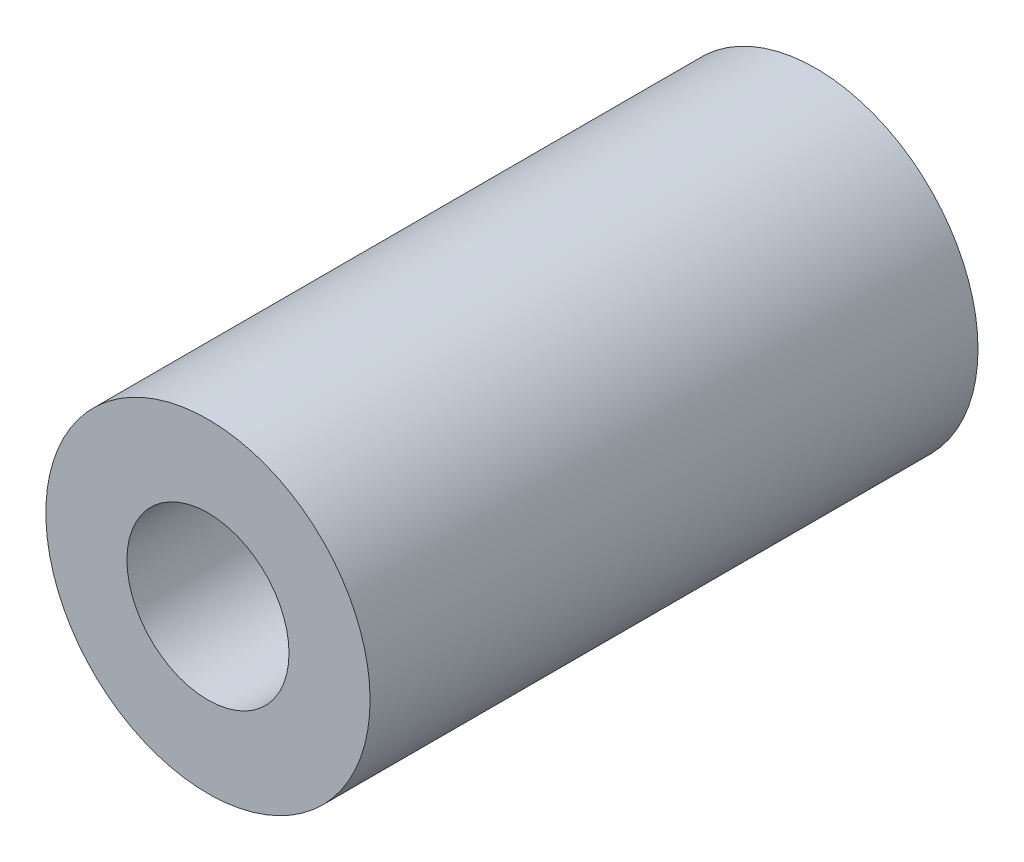
ISO-10303-21;
HEADER;
FILE_DESCRIPTION(('STEP AP214'),'2;1');
FILE_NAME('part.step','',(''),(''),'','','');
FILE_SCHEMA(('AUTOMOTIVE_DESIGN { 1 0 10303 214 1 1 1 1 }'));
ENDSEC;
DATA;
#1=APPLICATION_CONTEXT('core data for automotive mechanical design processes');
#2=APPLICATION_PROTOCOL_DEFINITION('international standard','automotive_design',2000,#1);
#3=PRODUCT_CONTEXT('',#1,'mechanical');
#4=PRODUCT('Part','Part','',(#3));
#5=PRODUCT_RELATED_PRODUCT_CATEGORY('part','',(#4));
#6=PRODUCT_DEFINITION_FORMATION('','',#4);
#7=PRODUCT_DEFINITION_CONTEXT('part definition',#1,'design');
#8=PRODUCT_DEFINITION('design','',#6,#7);
#9=PRODUCT_DEFINITION_SHAPE('','',#8);
#10=(LENGTH_UNIT() NAMED_UNIT(*) SI_UNIT(.MILLI.,.METRE.));
#11=(NAMED_UNIT(*) PLANE_ANGLE_UNIT() SI_UNIT($,.RADIAN.));
#12=(NAMED_UNIT(*) SI_UNIT($,.STERADIAN.) SOLID_ANGLE_UNIT());
#13=UNCERTAINTY_MEASURE_WITH_UNIT(LENGTH_MEASURE(1.E-05),#10,'distance_accuracy_value','');
#14=(GEOMETRIC_REPRESENTATION_CONTEXT(3) GLOBAL_UNCERTAINTY_ASSIGNED_CONTEXT((#13)) GLOBAL_UNIT_ASSIGNED_CONTEXT((#10,
#11,#12)) REPRESENTATION_CONTEXT('',''));
#15=CARTESIAN_POINT('',(0.,0.,0.));
#16=DIRECTION('',(0.,0.,1.));
#17=DIRECTION('',(1.,0.,0.));
#18=AXIS2_PLACEMENT_3D('',#15,#16,#17);
#19=CARTESIAN_POINT('',(0.,0.,7.5));
#20=DIRECTION('',(0.,0.,1.));
#21=DIRECTION('',(1.,0.,0.));
#22=AXIS2_PLACEMENT_3D('',#19,#20,#21);
#23=PLANE('',#22);
#24=CARTESIAN_POINT('',(0.,0.,7.5));
#25=DIRECTION('',(0.,0.,1.));
#26=DIRECTION('',(1.,0.,0.));
#27=AXIS2_PLACEMENT_3D('',#24,#25,#26);
#28=CIRCLE('',#27,4.);
#29=CARTESIAN_POINT('',(4.,0.,7.5));
#30=VERTEX_POINT('',#29);
#31=EDGE_CURVE('E10',#30,#30,#28,.T.);
#32=ORIENTED_EDGE('',*,*,#31,.T.);
#33=EDGE_LOOP('',(#32));
#34=FACE_BOUND('',#33,.T.);
#35=CARTESIAN_POINT('',(0.,0.,7.5));
#36=DIRECTION('',(0.,0.,1.));
#37=DIRECTION('',(1.,0.,0.));
#38=AXIS2_PLACEMENT_3D('',#35,#36,#37);
#39=CIRCLE('',#38,2.);
#40=CARTESIAN_POINT('',(2.,0.,7.5));
#41=VERTEX_POINT('',#40);
#42=EDGE_CURVE('E41',#41,#41,#39,.T.);
#43=ORIENTED_EDGE('',*,*,#42,.F.);
#44=EDGE_LOOP('',(#43));
#45=FACE_BOUND('',#44,.T.);
#46=ADVANCED_FACE('F30',(#34,#45),#23,.T.);
#47=CARTESIAN_POINT('',(0.,0.,-7.5));
#48=DIRECTION('',(0.,0.,1.));
#49=DIRECTION('',(1.,0.,0.));
#50=AXIS2_PLACEMENT_3D('',#47,#48,#49);
#51=PLANE('',#50);
#52=CARTESIAN_POINT('',(0.,0.,-7.5));
#53=DIRECTION('',(0.,0.,1.));
#54=DIRECTION('',(1.,0.,0.));
#55=AXIS2_PLACEMENT_3D('',#52,#53,#54);
#56=CIRCLE('',#55,4.);
#57=CARTESIAN_POINT('',(4.,0.,-7.5));
#58=VERTEX_POINT('',#57);
#59=EDGE_CURVE('E34',#58,#58,#56,.T.);
#60=ORIENTED_EDGE('',*,*,#59,.F.);
#61=EDGE_LOOP('',(#60));
#62=FACE_BOUND('',#61,.T.);
#63=CARTESIAN_POINT('',(0.,0.,-7.5));
#64=DIRECTION('',(0.,0.,1.));
#65=DIRECTION('',(1.,0.,0.));
#66=AXIS2_PLACEMENT_3D('',#63,#64,#65);
#67=CIRCLE('',#66,2.);
#68=CARTESIAN_POINT('',(2.,0.,-7.5));
#69=VERTEX_POINT('',#68);
#70=EDGE_CURVE('E43',#69,#69,#67,.T.);
#71=ORIENTED_EDGE('',*,*,#70,.T.);
#72=EDGE_LOOP('',(#71));
#73=FACE_BOUND('',#72,.T.);
#74=ADVANCED_FACE('F53',(#62,#73),#51,.F.);
#75=CARTESIAN_POINT('',(0.,0.,7.5));
#76=DIRECTION('',(0.,0.,-1.));
#77=DIRECTION('',(-1.,0.,0.));
#78=AXIS2_PLACEMENT_3D('',#75,#76,#77);
#79=CYLINDRICAL_SURFACE('',#78,4.);
#80=ORIENTED_EDGE('',*,*,#31,.F.);
#81=EDGE_LOOP('',(#80));
#82=FACE_BOUND('',#81,.T.);
#83=ORIENTED_EDGE('',*,*,#59,.T.);
#84=EDGE_LOOP('',(#83));
#85=FACE_BOUND('',#84,.T.);
#86=ADVANCED_FACE('F32',(#82,#85),#79,.T.);
#87=CARTESIAN_POINT('',(0.,0.,7.5));
#88=DIRECTION('',(0.,0.,-1.));
#89=DIRECTION('',(-1.,0.,0.));
#90=AXIS2_PLACEMENT_3D('',#87,#88,#89);
#91=CYLINDRICAL_SURFACE('',#90,2.);
#92=ORIENTED_EDGE('',*,*,#42,.T.);
#93=EDGE_LOOP('',(#92));
#94=FACE_BOUND('',#93,.T.);
#95=ORIENTED_EDGE('',*,*,#70,.F.);
#96=EDGE_LOOP('',(#95));
#97=FACE_BOUND('',#96,.T.);
#98=ADVANCED_FACE('F49',(#94,#97),#91,.F.);
#99=CLOSED_SHELL('',(#46,#74,#86,#98));
#100=MANIFOLD_SOLID_BREP('B2',#99);
#101=ADVANCED_BREP_SHAPE_REPRESENTATION('',(#18,#100),#14);
#102=SHAPE_DEFINITION_REPRESENTATION(#9,#101);
ENDSEC;
END-ISO-10303-21;
